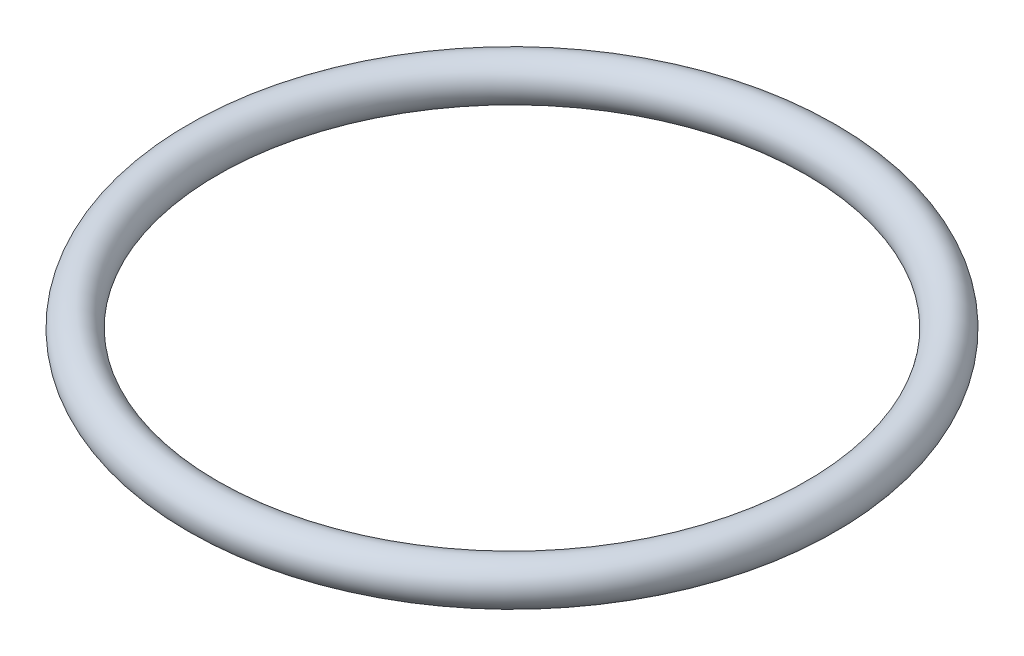
ISO-10303-21;
HEADER;
FILE_DESCRIPTION(('STEP AP214'),'2;1');
FILE_NAME('part.step','',(''),(''),'','','');
FILE_SCHEMA(('AUTOMOTIVE_DESIGN { 1 0 10303 214 1 1 1 1 }'));
ENDSEC;
DATA;
#1=APPLICATION_CONTEXT('core data for automotive mechanical design processes');
#2=APPLICATION_PROTOCOL_DEFINITION('international standard','automotive_design',2000,#1);
#3=PRODUCT_CONTEXT('',#1,'mechanical');
#4=PRODUCT('Part','Part','',(#3));
#5=PRODUCT_RELATED_PRODUCT_CATEGORY('part','',(#4));
#6=PRODUCT_DEFINITION_FORMATION('','',#4);
#7=PRODUCT_DEFINITION_CONTEXT('part definition',#1,'design');
#8=PRODUCT_DEFINITION('design','',#6,#7);
#9=PRODUCT_DEFINITION_SHAPE('','',#8);
#10=(LENGTH_UNIT() NAMED_UNIT(*) SI_UNIT(.MILLI.,.METRE.));
#11=(NAMED_UNIT(*) PLANE_ANGLE_UNIT() SI_UNIT($,.RADIAN.));
#12=(NAMED_UNIT(*) SI_UNIT($,.STERADIAN.) SOLID_ANGLE_UNIT());
#13=UNCERTAINTY_MEASURE_WITH_UNIT(LENGTH_MEASURE(1.E-05),#10,'distance_accuracy_value','');
#14=(GEOMETRIC_REPRESENTATION_CONTEXT(3) GLOBAL_UNCERTAINTY_ASSIGNED_CONTEXT((#13)) GLOBAL_UNIT_ASSIGNED_CONTEXT((#10,
#11,#12)) REPRESENTATION_CONTEXT('',''));
#15=CARTESIAN_POINT('',(0.,0.,0.));
#16=DIRECTION('',(0.,0.,1.));
#17=DIRECTION('',(1.,0.,0.));
#18=AXIS2_PLACEMENT_3D('',#15,#16,#17);
#19=CARTESIAN_POINT('',(0.,0.,0.));
#20=DIRECTION('',(0.,1.,0.));
#21=DIRECTION('',(0.,0.,1.));
#22=AXIS2_PLACEMENT_3D('',#19,#20,#21);
#23=TOROIDAL_SURFACE('',#22,150.,10.);
#24=CARTESIAN_POINT('',(0.,0.,160.));
#25=VERTEX_POINT('',#24);
#26=VERTEX_LOOP('',#25);
#27=FACE_BOUND('',#26,.T.);
#28=ADVANCED_FACE('F33',(#27),#23,.T.);
#29=CLOSED_SHELL('',(#28));
#30=MANIFOLD_SOLID_BREP('B2',#29);
#31=ADVANCED_BREP_SHAPE_REPRESENTATION('',(#18,#30),#14);
#32=SHAPE_DEFINITION_REPRESENTATION(#9,#31);
ENDSEC;
END-ISO-10303-21;
